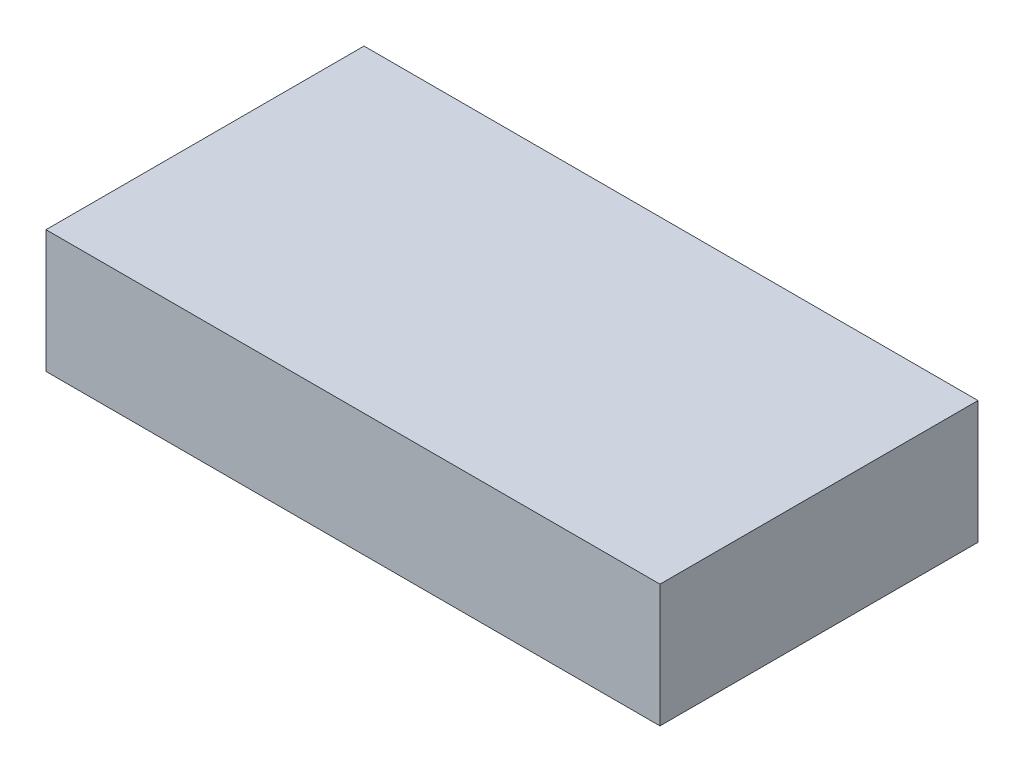
ISO-10303-21;
HEADER;
FILE_DESCRIPTION(('STEP AP214'),'2;1');
FILE_NAME('part.step','',(''),(''),'','','');
FILE_SCHEMA(('AUTOMOTIVE_DESIGN { 1 0 10303 214 1 1 1 1 }'));
ENDSEC;
DATA;
#1=APPLICATION_CONTEXT('core data for automotive mechanical design processes');
#2=APPLICATION_PROTOCOL_DEFINITION('international standard','automotive_design',2000,#1);
#3=PRODUCT_CONTEXT('',#1,'mechanical');
#4=PRODUCT('Part','Part','',(#3));
#5=PRODUCT_RELATED_PRODUCT_CATEGORY('part','',(#4));
#6=PRODUCT_DEFINITION_FORMATION('','',#4);
#7=PRODUCT_DEFINITION_CONTEXT('part definition',#1,'design');
#8=PRODUCT_DEFINITION('design','',#6,#7);
#9=PRODUCT_DEFINITION_SHAPE('','',#8);
#10=(LENGTH_UNIT() NAMED_UNIT(*) SI_UNIT(.MILLI.,.METRE.));
#11=(NAMED_UNIT(*) PLANE_ANGLE_UNIT() SI_UNIT($,.RADIAN.));
#12=(NAMED_UNIT(*) SI_UNIT($,.STERADIAN.) SOLID_ANGLE_UNIT());
#13=UNCERTAINTY_MEASURE_WITH_UNIT(LENGTH_MEASURE(1.E-05),#10,'distance_accuracy_value','');
#14=(GEOMETRIC_REPRESENTATION_CONTEXT(3) GLOBAL_UNCERTAINTY_ASSIGNED_CONTEXT((#13)) GLOBAL_UNIT_ASSIGNED_CONTEXT((#10,
#11,#12)) REPRESENTATION_CONTEXT('',''));
#15=CARTESIAN_POINT('',(0.,0.,0.));
#16=DIRECTION('',(0.,0.,1.));
#17=DIRECTION('',(1.,0.,0.));
#18=AXIS2_PLACEMENT_3D('',#15,#16,#17);
#19=CARTESIAN_POINT('',(-24.7408372320355,10.,6.79265959973518));
#20=DIRECTION('',(-1.,0.,0.));
#21=DIRECTION('',(0.,0.,1.));
#22=AXIS2_PLACEMENT_3D('',#19,#20,#21);
#23=PLANE('',#22);
#24=DIRECTION('',(0.,0.,-1.));
#25=VECTOR('',#24,1.);
#26=CARTESIAN_POINT('',(-24.7408372320355,0.,6.79265959973518));
#27=LINE('',#26,#25);
#28=CARTESIAN_POINT('',(-24.7408372320355,0.,32.6926595997352));
#29=VERTEX_POINT('',#28);
#30=CARTESIAN_POINT('',(-24.7408372320355,0.,6.79265959973518));
#31=VERTEX_POINT('',#30);
#32=EDGE_CURVE('E113',#29,#31,#27,.T.);
#33=ORIENTED_EDGE('',*,*,#32,.T.);
#34=DIRECTION('',(0.,-1.,0.));
#35=VECTOR('',#34,1.);
#36=CARTESIAN_POINT('',(-24.7408372320355,10.,6.79265959973518));
#37=LINE('',#36,#35);
#38=CARTESIAN_POINT('',(-24.7408372320355,10.,6.79265959973518));
#39=VERTEX_POINT('',#38);
#40=EDGE_CURVE('E11',#39,#31,#37,.T.);
#41=ORIENTED_EDGE('',*,*,#40,.F.);
#42=DIRECTION('',(0.,0.,-1.));
#43=VECTOR('',#42,1.);
#44=CARTESIAN_POINT('',(-24.7408372320355,10.,6.79265959973518));
#45=LINE('',#44,#43);
#46=CARTESIAN_POINT('',(-24.7408372320355,10.,32.6926595997352));
#47=VERTEX_POINT('',#46);
#48=EDGE_CURVE('E97',#47,#39,#45,.T.);
#49=ORIENTED_EDGE('',*,*,#48,.F.);
#50=DIRECTION('',(0.,-1.,0.));
#51=VECTOR('',#50,1.);
#52=CARTESIAN_POINT('',(-24.7408372320355,10.,32.6926595997352));
#53=LINE('',#52,#51);
#54=EDGE_CURVE('E109',#47,#29,#53,.T.);
#55=ORIENTED_EDGE('',*,*,#54,.T.);
#56=EDGE_LOOP('',(#33,#41,#49,#55));
#57=FACE_BOUND('',#56,.T.);
#58=ADVANCED_FACE('F45',(#57),#23,.F.);
#59=CARTESIAN_POINT('',(-74.7408372320355,10.,6.79265959973517));
#60=DIRECTION('',(0.,0.,1.));
#61=DIRECTION('',(1.,0.,0.));
#62=AXIS2_PLACEMENT_3D('',#59,#60,#61);
#63=PLANE('',#62);
#64=DIRECTION('',(-1.,0.,0.));
#65=VECTOR('',#64,1.);
#66=CARTESIAN_POINT('',(-74.7408372320355,0.,6.79265959973517));
#67=LINE('',#66,#65);
#68=CARTESIAN_POINT('',(-74.7408372320355,0.,6.79265959973517));
#69=VERTEX_POINT('',#68);
#70=EDGE_CURVE('E102',#31,#69,#67,.T.);
#71=ORIENTED_EDGE('',*,*,#70,.T.);
#72=DIRECTION('',(0.,-1.,0.));
#73=VECTOR('',#72,1.);
#74=CARTESIAN_POINT('',(-74.7408372320355,10.,6.79265959973517));
#75=LINE('',#74,#73);
#76=CARTESIAN_POINT('',(-74.7408372320355,10.,6.79265959973517));
#77=VERTEX_POINT('',#76);
#78=EDGE_CURVE('E54',#77,#69,#75,.T.);
#79=ORIENTED_EDGE('',*,*,#78,.F.);
#80=DIRECTION('',(-1.,0.,0.));
#81=VECTOR('',#80,1.);
#82=CARTESIAN_POINT('',(-74.7408372320355,10.,6.79265959973517));
#83=LINE('',#82,#81);
#84=EDGE_CURVE('E92',#39,#77,#83,.T.);
#85=ORIENTED_EDGE('',*,*,#84,.F.);
#86=ORIENTED_EDGE('',*,*,#40,.T.);
#87=EDGE_LOOP('',(#71,#79,#85,#86));
#88=FACE_BOUND('',#87,.T.);
#89=ADVANCED_FACE('F101',(#88),#63,.F.);
#90=CARTESIAN_POINT('',(-74.7408372320355,10.,6.79265959973517));
#91=DIRECTION('',(1.,0.,0.));
#92=DIRECTION('',(0.,0.,-1.));
#93=AXIS2_PLACEMENT_3D('',#90,#91,#92);
#94=PLANE('',#93);
#95=DIRECTION('',(0.,0.,1.));
#96=VECTOR('',#95,1.);
#97=CARTESIAN_POINT('',(-74.7408372320355,0.,6.79265959973517));
#98=LINE('',#97,#96);
#99=CARTESIAN_POINT('',(-74.7408372320355,0.,32.6926595997352));
#100=VERTEX_POINT('',#99);
#101=EDGE_CURVE('E79',#69,#100,#98,.T.);
#102=ORIENTED_EDGE('',*,*,#101,.T.);
#103=DIRECTION('',(0.,-1.,0.));
#104=VECTOR('',#103,1.);
#105=CARTESIAN_POINT('',(-74.7408372320355,10.,32.6926595997352));
#106=LINE('',#105,#104);
#107=CARTESIAN_POINT('',(-74.7408372320355,10.,32.6926595997352));
#108=VERTEX_POINT('',#107);
#109=EDGE_CURVE('E104',#108,#100,#106,.T.);
#110=ORIENTED_EDGE('',*,*,#109,.F.);
#111=DIRECTION('',(0.,0.,1.));
#112=VECTOR('',#111,1.);
#113=CARTESIAN_POINT('',(-74.7408372320355,10.,6.79265959973517));
#114=LINE('',#113,#112);
#115=EDGE_CURVE('E95',#77,#108,#114,.T.);
#116=ORIENTED_EDGE('',*,*,#115,.F.);
#117=ORIENTED_EDGE('',*,*,#78,.T.);
#118=EDGE_LOOP('',(#102,#110,#116,#117));
#119=FACE_BOUND('',#118,.T.);
#120=ADVANCED_FACE('F105',(#119),#94,.F.);
#121=CARTESIAN_POINT('',(-74.7408372320355,10.,32.6926595997352));
#122=DIRECTION('',(0.,0.,-1.));
#123=DIRECTION('',(-1.,0.,0.));
#124=AXIS2_PLACEMENT_3D('',#121,#122,#123);
#125=PLANE('',#124);
#126=DIRECTION('',(1.,0.,0.));
#127=VECTOR('',#126,1.);
#128=CARTESIAN_POINT('',(-74.7408372320355,0.,32.6926595997352));
#129=LINE('',#128,#127);
#130=EDGE_CURVE('E85',#100,#29,#129,.T.);
#131=ORIENTED_EDGE('',*,*,#130,.T.);
#132=ORIENTED_EDGE('',*,*,#54,.F.);
#133=DIRECTION('',(1.,0.,0.));
#134=VECTOR('',#133,1.);
#135=CARTESIAN_POINT('',(-74.7408372320355,10.,32.6926595997352));
#136=LINE('',#135,#134);
#137=EDGE_CURVE('E62',#108,#47,#136,.T.);
#138=ORIENTED_EDGE('',*,*,#137,.F.);
#139=ORIENTED_EDGE('',*,*,#109,.T.);
#140=EDGE_LOOP('',(#131,#132,#138,#139));
#141=FACE_BOUND('',#140,.T.);
#142=ADVANCED_FACE('F126',(#141),#125,.F.);
#143=CARTESIAN_POINT('',(0.,10.,0.));
#144=DIRECTION('',(0.,1.,0.));
#145=DIRECTION('',(0.,0.,1.));
#146=AXIS2_PLACEMENT_3D('',#143,#144,#145);
#147=PLANE('',#146);
#148=ORIENTED_EDGE('',*,*,#48,.T.);
#149=ORIENTED_EDGE('',*,*,#84,.T.);
#150=ORIENTED_EDGE('',*,*,#115,.T.);
#151=ORIENTED_EDGE('',*,*,#137,.T.);
#152=EDGE_LOOP('',(#148,#149,#150,#151));
#153=FACE_BOUND('',#152,.T.);
#154=ADVANCED_FACE('F93',(#153),#147,.T.);
#155=CARTESIAN_POINT('',(0.,0.,0.));
#156=DIRECTION('',(0.,1.,0.));
#157=DIRECTION('',(0.,0.,1.));
#158=AXIS2_PLACEMENT_3D('',#155,#156,#157);
#159=PLANE('',#158);
#160=ORIENTED_EDGE('',*,*,#32,.F.);
#161=ORIENTED_EDGE('',*,*,#130,.F.);
#162=ORIENTED_EDGE('',*,*,#101,.F.);
#163=ORIENTED_EDGE('',*,*,#70,.F.);
#164=EDGE_LOOP('',(#160,#161,#162,#163));
#165=FACE_BOUND('',#164,.T.);
#166=ADVANCED_FACE('F129',(#165),#159,.F.);
#167=CLOSED_SHELL('',(#58,#89,#120,#142,#154,#166));
#168=MANIFOLD_SOLID_BREP('B2',#167);
#169=ADVANCED_BREP_SHAPE_REPRESENTATION('',(#18,#168),#14);
#170=SHAPE_DEFINITION_REPRESENTATION(#9,#169);
ENDSEC;
END-ISO-10303-21;
